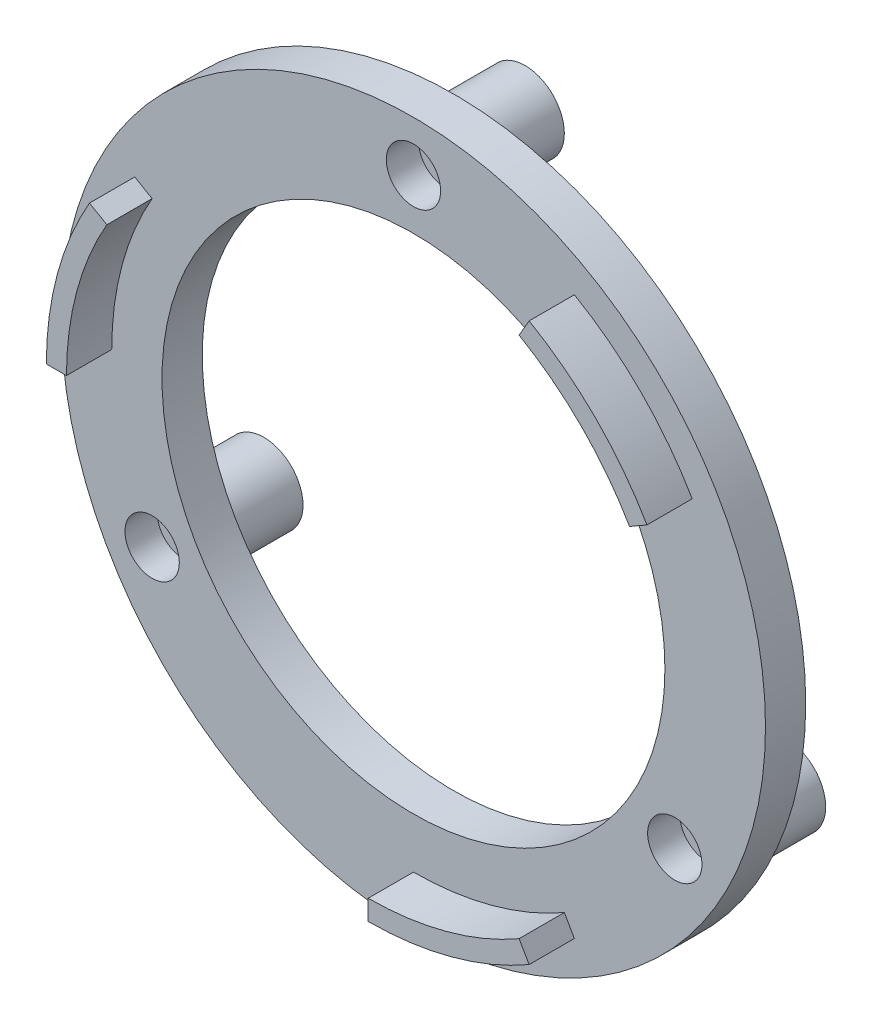
ISO-10303-21;
HEADER;
FILE_DESCRIPTION(('STEP AP214'),'2;1');
FILE_NAME('part.step','',(''),(''),'','','');
FILE_SCHEMA(('AUTOMOTIVE_DESIGN { 1 0 10303 214 1 1 1 1 }'));
ENDSEC;
DATA;
#1=APPLICATION_CONTEXT('core data for automotive mechanical design processes');
#2=APPLICATION_PROTOCOL_DEFINITION('international standard','automotive_design',2000,#1);
#3=PRODUCT_CONTEXT('',#1,'mechanical');
#4=PRODUCT('Part','Part','',(#3));
#5=PRODUCT_RELATED_PRODUCT_CATEGORY('part','',(#4));
#6=PRODUCT_DEFINITION_FORMATION('','',#4);
#7=PRODUCT_DEFINITION_CONTEXT('part definition',#1,'design');
#8=PRODUCT_DEFINITION('design','',#6,#7);
#9=PRODUCT_DEFINITION_SHAPE('','',#8);
#10=(LENGTH_UNIT() NAMED_UNIT(*) SI_UNIT(.MILLI.,.METRE.));
#11=(NAMED_UNIT(*) PLANE_ANGLE_UNIT() SI_UNIT($,.RADIAN.));
#12=(NAMED_UNIT(*) SI_UNIT($,.STERADIAN.) SOLID_ANGLE_UNIT());
#13=UNCERTAINTY_MEASURE_WITH_UNIT(LENGTH_MEASURE(1.E-05),#10,'distance_accuracy_value','');
#14=(GEOMETRIC_REPRESENTATION_CONTEXT(3) GLOBAL_UNCERTAINTY_ASSIGNED_CONTEXT((#13)) GLOBAL_UNIT_ASSIGNED_CONTEXT((#10,
#11,#12)) REPRESENTATION_CONTEXT('',''));
#15=CARTESIAN_POINT('',(0.,0.,0.));
#16=DIRECTION('',(0.,0.,1.));
#17=DIRECTION('',(1.,0.,0.));
#18=AXIS2_PLACEMENT_3D('',#15,#16,#17);
#19=CARTESIAN_POINT('',(0.,0.,4.));
#20=DIRECTION('',(0.,0.,1.));
#21=DIRECTION('',(1.,0.,0.));
#22=AXIS2_PLACEMENT_3D('',#19,#20,#21);
#23=PLANE('',#22);
#24=CARTESIAN_POINT('',(0.,0.,4.));
#25=DIRECTION('',(0.,0.,1.));
#26=DIRECTION('',(1.,0.,0.));
#27=AXIS2_PLACEMENT_3D('',#24,#25,#26);
#28=CIRCLE('',#27,30.);
#29=CARTESIAN_POINT('',(25.9807621135331,15.,4.));
#30=VERTEX_POINT('',#29);
#31=CARTESIAN_POINT('',(14.9999999999999,25.9807621135332,4.));
#32=VERTEX_POINT('',#31);
#33=EDGE_CURVE('E183',#30,#32,#28,.T.);
#34=ORIENTED_EDGE('',*,*,#33,.T.);
#35=DIRECTION('',(0.499999999999998,0.86602540378444,0.));
#36=VECTOR('',#35,1.);
#37=CARTESIAN_POINT('',(0.,0.,4.));
#38=LINE('',#37,#36);
#39=CARTESIAN_POINT('',(15.9999999999999,27.7128129211021,4.));
#40=VERTEX_POINT('',#39);
#41=EDGE_CURVE('E196',#32,#40,#38,.T.);
#42=ORIENTED_EDGE('',*,*,#41,.T.);
#43=CARTESIAN_POINT('',(0.,0.,4.));
#44=DIRECTION('',(0.,0.,1.));
#45=DIRECTION('',(1.,0.,0.));
#46=AXIS2_PLACEMENT_3D('',#43,#44,#45);
#47=CIRCLE('',#46,32.);
#48=CARTESIAN_POINT('',(27.712812921102,16.,4.));
#49=VERTEX_POINT('',#48);
#50=EDGE_CURVE('E208',#49,#40,#47,.T.);
#51=ORIENTED_EDGE('',*,*,#50,.F.);
#52=DIRECTION('',(0.866025403784438,0.500000000000001,0.));
#53=VECTOR('',#52,1.);
#54=CARTESIAN_POINT('',(0.,0.,4.));
#55=LINE('',#54,#53);
#56=EDGE_CURVE('E205',#30,#49,#55,.T.);
#57=ORIENTED_EDGE('',*,*,#56,.F.);
#58=EDGE_LOOP('',(#34,#42,#51,#57));
#59=FACE_BOUND('',#58,.T.);
#60=CARTESIAN_POINT('',(0.,30.,4.));
#61=DIRECTION('',(0.,0.,1.));
#62=DIRECTION('',(1.,0.,0.));
#63=AXIS2_PLACEMENT_3D('',#60,#61,#62);
#64=CIRCLE('',#63,2.7);
#65=CARTESIAN_POINT('',(2.7,30.,4.));
#66=VERTEX_POINT('',#65);
#67=EDGE_CURVE('E228',#66,#66,#64,.T.);
#68=ORIENTED_EDGE('',*,*,#67,.F.);
#69=EDGE_LOOP('',(#68));
#70=FACE_BOUND('',#69,.T.);
#71=CARTESIAN_POINT('',(25.9807621135351,-14.9999999999989,4.));
#72=DIRECTION('',(0.,0.,1.));
#73=DIRECTION('',(1.,0.,0.));
#74=AXIS2_PLACEMENT_3D('',#71,#72,#73);
#75=CIRCLE('',#74,2.70000000000167);
#76=CARTESIAN_POINT('',(28.6807621135367,-14.9999999999989,4.));
#77=VERTEX_POINT('',#76);
#78=EDGE_CURVE('E231',#77,#77,#75,.T.);
#79=ORIENTED_EDGE('',*,*,#78,.F.);
#80=EDGE_LOOP('',(#79));
#81=FACE_BOUND('',#80,.T.);
#82=CARTESIAN_POINT('',(-25.9807621135312,-15.0000000000011,4.));
#83=DIRECTION('',(0.,0.,1.));
#84=DIRECTION('',(1.,0.,0.));
#85=AXIS2_PLACEMENT_3D('',#82,#83,#84);
#86=CIRCLE('',#85,2.70000000000243);
#87=CARTESIAN_POINT('',(-23.2807621135288,-15.0000000000011,4.));
#88=VERTEX_POINT('',#87);
#89=EDGE_CURVE('E237',#88,#88,#86,.T.);
#90=ORIENTED_EDGE('',*,*,#89,.F.);
#91=EDGE_LOOP('',(#90));
#92=FACE_BOUND('',#91,.T.);
#93=CARTESIAN_POINT('',(0.,0.,4.));
#94=DIRECTION('',(0.,0.,1.));
#95=DIRECTION('',(1.,0.,0.));
#96=AXIS2_PLACEMENT_3D('',#93,#94,#95);
#97=CIRCLE('',#96,35.);
#98=CARTESIAN_POINT('',(35.,0.,4.));
#99=VERTEX_POINT('',#98);
#100=EDGE_CURVE('E261',#99,#99,#97,.T.);
#101=ORIENTED_EDGE('',*,*,#100,.T.);
#102=EDGE_LOOP('',(#101));
#103=FACE_BOUND('',#102,.T.);
#104=CARTESIAN_POINT('',(0.,0.,4.));
#105=DIRECTION('',(0.,0.,1.));
#106=DIRECTION('',(1.,0.,0.));
#107=AXIS2_PLACEMENT_3D('',#104,#105,#106);
#108=CIRCLE('',#107,25.);
#109=CARTESIAN_POINT('',(25.,0.,4.));
#110=VERTEX_POINT('',#109);
#111=EDGE_CURVE('E264',#110,#110,#108,.T.);
#112=ORIENTED_EDGE('',*,*,#111,.F.);
#113=EDGE_LOOP('',(#112));
#114=FACE_BOUND('',#113,.T.);
#115=DIRECTION('',(1.,0.,0.));
#116=VECTOR('',#115,1.);
#117=CARTESIAN_POINT('',(-32.,2.15105711021124E-13,4.));
#118=LINE('',#117,#116);
#119=CARTESIAN_POINT('',(-32.,2.15105711021124E-13,4.));
#120=VERTEX_POINT('',#119);
#121=CARTESIAN_POINT('',(-30.,2.02962646689286E-13,4.));
#122=VERTEX_POINT('',#121);
#123=EDGE_CURVE('E177',#120,#122,#118,.T.);
#124=ORIENTED_EDGE('',*,*,#123,.F.);
#125=CARTESIAN_POINT('',(0.,0.,4.));
#126=DIRECTION('',(0.,0.,1.));
#127=DIRECTION('',(1.,0.,0.));
#128=AXIS2_PLACEMENT_3D('',#125,#126,#127);
#129=CIRCLE('',#128,32.);
#130=CARTESIAN_POINT('',(-27.7128129211019,16.0000000000002,4.));
#131=VERTEX_POINT('',#130);
#132=EDGE_CURVE('E180',#131,#120,#129,.T.);
#133=ORIENTED_EDGE('',*,*,#132,.F.);
#134=DIRECTION('',(-0.866025403784435,0.500000000000007,0.));
#135=VECTOR('',#134,1.);
#136=CARTESIAN_POINT('',(-25.980762113533,15.0000000000002,4.));
#137=LINE('',#136,#135);
#138=CARTESIAN_POINT('',(-25.980762113533,15.0000000000002,4.));
#139=VERTEX_POINT('',#138);
#140=EDGE_CURVE('E173',#139,#131,#137,.T.);
#141=ORIENTED_EDGE('',*,*,#140,.F.);
#142=CARTESIAN_POINT('',(0.,0.,4.));
#143=DIRECTION('',(0.,0.,1.));
#144=DIRECTION('',(1.,0.,0.));
#145=AXIS2_PLACEMENT_3D('',#142,#143,#144);
#146=CIRCLE('',#145,30.);
#147=EDGE_CURVE('E64',#139,#122,#146,.T.);
#148=ORIENTED_EDGE('',*,*,#147,.T.);
#149=EDGE_LOOP('',(#124,#133,#141,#148));
#150=FACE_BOUND('',#149,.T.);
#151=DIRECTION('',(-0.499999999999998,0.86602540378444,0.));
#152=VECTOR('',#151,1.);
#153=CARTESIAN_POINT('',(15.9999999999999,-27.7128129211021,4.));
#154=LINE('',#153,#152);
#155=CARTESIAN_POINT('',(15.9999999999999,-27.7128129211021,4.));
#156=VERTEX_POINT('',#155);
#157=CARTESIAN_POINT('',(14.9999999999999,-25.9807621135332,4.));
#158=VERTEX_POINT('',#157);
#159=EDGE_CURVE('E151',#156,#158,#154,.T.);
#160=ORIENTED_EDGE('',*,*,#159,.F.);
#161=CARTESIAN_POINT('',(0.,0.,4.));
#162=DIRECTION('',(0.,0.,1.));
#163=DIRECTION('',(1.,0.,0.));
#164=AXIS2_PLACEMENT_3D('',#161,#162,#163);
#165=CIRCLE('',#164,32.);
#166=CARTESIAN_POINT('',(-1.12757025938492E-13,-32.,4.));
#167=VERTEX_POINT('',#166);
#168=EDGE_CURVE('E145',#167,#156,#165,.T.);
#169=ORIENTED_EDGE('',*,*,#168,.F.);
#170=DIRECTION('',(0.,-1.,0.));
#171=VECTOR('',#170,1.);
#172=CARTESIAN_POINT('',(-1.05818132034585E-13,-30.,4.));
#173=LINE('',#172,#171);
#174=CARTESIAN_POINT('',(-1.05818132034585E-13,-30.,4.));
#175=VERTEX_POINT('',#174);
#176=EDGE_CURVE('E130',#175,#167,#173,.T.);
#177=ORIENTED_EDGE('',*,*,#176,.F.);
#178=CARTESIAN_POINT('',(0.,0.,4.));
#179=DIRECTION('',(0.,0.,1.));
#180=DIRECTION('',(1.,0.,0.));
#181=AXIS2_PLACEMENT_3D('',#178,#179,#180);
#182=CIRCLE('',#181,30.);
#183=EDGE_CURVE('E56',#175,#158,#182,.T.);
#184=ORIENTED_EDGE('',*,*,#183,.T.);
#185=EDGE_LOOP('',(#160,#169,#177,#184));
#186=FACE_BOUND('',#185,.T.);
#187=ADVANCED_FACE('F39',(#59,#70,#81,#92,#103,#114,#150,#186),#23,.T.);
#188=CARTESIAN_POINT('',(-25.9807621135351,-14.9999999999989,7.9));
#189=DIRECTION('',(0.,0.,-1.));
#190=DIRECTION('',(-1.,0.,0.));
#191=AXIS2_PLACEMENT_3D('',#188,#189,#190);
#192=CYLINDRICAL_SURFACE('',#191,1.60000000000166);
#193=CARTESIAN_POINT('',(-25.9807621135351,-14.9999999999989,-7.1));
#194=DIRECTION('',(0.,0.,-1.));
#195=DIRECTION('',(-1.,0.,0.));
#196=AXIS2_PLACEMENT_3D('',#193,#194,#195);
#197=CIRCLE('',#196,1.60000000000166);
#198=CARTESIAN_POINT('',(-27.5807621135367,-14.9999999999989,-7.1));
#199=VERTEX_POINT('',#198);
#200=EDGE_CURVE('E246',#199,#199,#197,.T.);
#201=ORIENTED_EDGE('',*,*,#200,.T.);
#202=EDGE_LOOP('',(#201));
#203=FACE_BOUND('',#202,.T.);
#204=CARTESIAN_POINT('',(-25.9807621135351,-14.9999999999989,0.8));
#205=DIRECTION('',(0.,0.,1.));
#206=DIRECTION('',(1.,0.,0.));
#207=AXIS2_PLACEMENT_3D('',#204,#205,#206);
#208=CIRCLE('',#207,1.60000000000166);
#209=CARTESIAN_POINT('',(-24.3807621135334,-14.9999999999989,0.8));
#210=VERTEX_POINT('',#209);
#211=EDGE_CURVE('E43',#210,#210,#208,.F.);
#212=ORIENTED_EDGE('',*,*,#211,.F.);
#213=EDGE_LOOP('',(#212));
#214=FACE_BOUND('',#213,.T.);
#215=ADVANCED_FACE('F287',(#203,#214),#192,.F.);
#216=CARTESIAN_POINT('',(25.9807621135312,-15.0000000000011,7.9));
#217=DIRECTION('',(0.,0.,-1.));
#218=DIRECTION('',(-1.,0.,0.));
#219=AXIS2_PLACEMENT_3D('',#216,#217,#218);
#220=CYLINDRICAL_SURFACE('',#219,1.60000000000243);
#221=CARTESIAN_POINT('',(25.9807621135312,-15.0000000000011,-7.1));
#222=DIRECTION('',(0.,0.,-1.));
#223=DIRECTION('',(-1.,0.,0.));
#224=AXIS2_PLACEMENT_3D('',#221,#222,#223);
#225=CIRCLE('',#224,1.60000000000243);
#226=CARTESIAN_POINT('',(24.3807621135288,-15.0000000000011,-7.1));
#227=VERTEX_POINT('',#226);
#228=EDGE_CURVE('E249',#227,#227,#225,.T.);
#229=ORIENTED_EDGE('',*,*,#228,.T.);
#230=EDGE_LOOP('',(#229));
#231=FACE_BOUND('',#230,.T.);
#232=CARTESIAN_POINT('',(25.9807621135312,-15.0000000000011,0.8));
#233=DIRECTION('',(0.,0.,1.));
#234=DIRECTION('',(1.,0.,0.));
#235=AXIS2_PLACEMENT_3D('',#232,#233,#234);
#236=CIRCLE('',#235,1.60000000000243);
#237=CARTESIAN_POINT('',(27.5807621135337,-15.0000000000011,0.8));
#238=VERTEX_POINT('',#237);
#239=EDGE_CURVE('E278',#238,#238,#236,.F.);
#240=ORIENTED_EDGE('',*,*,#239,.F.);
#241=EDGE_LOOP('',(#240));
#242=FACE_BOUND('',#241,.T.);
#243=ADVANCED_FACE('F289',(#231,#242),#220,.F.);
#244=CARTESIAN_POINT('',(0.,30.,7.9));
#245=DIRECTION('',(0.,0.,-1.));
#246=DIRECTION('',(-1.,0.,0.));
#247=AXIS2_PLACEMENT_3D('',#244,#245,#246);
#248=CYLINDRICAL_SURFACE('',#247,1.6);
#249=CARTESIAN_POINT('',(0.,30.,-7.1));
#250=DIRECTION('',(0.,0.,-1.));
#251=DIRECTION('',(-1.,0.,0.));
#252=AXIS2_PLACEMENT_3D('',#249,#250,#251);
#253=CIRCLE('',#252,1.6);
#254=CARTESIAN_POINT('',(-1.6,30.,-7.1));
#255=VERTEX_POINT('',#254);
#256=EDGE_CURVE('E242',#255,#255,#253,.T.);
#257=ORIENTED_EDGE('',*,*,#256,.T.);
#258=EDGE_LOOP('',(#257));
#259=FACE_BOUND('',#258,.T.);
#260=CARTESIAN_POINT('',(0.,30.,0.8));
#261=DIRECTION('',(0.,0.,1.));
#262=DIRECTION('',(1.,0.,0.));
#263=AXIS2_PLACEMENT_3D('',#260,#261,#262);
#264=CIRCLE('',#263,1.6);
#265=CARTESIAN_POINT('',(1.6,30.,0.8));
#266=VERTEX_POINT('',#265);
#267=EDGE_CURVE('E227',#266,#266,#264,.F.);
#268=ORIENTED_EDGE('',*,*,#267,.F.);
#269=EDGE_LOOP('',(#268));
#270=FACE_BOUND('',#269,.T.);
#271=ADVANCED_FACE('F296',(#259,#270),#248,.F.);
#272=CARTESIAN_POINT('',(0.,0.,4.));
#273=DIRECTION('',(0.,0.,-1.));
#274=DIRECTION('',(-1.,0.,0.));
#275=AXIS2_PLACEMENT_3D('',#272,#273,#274);
#276=CYLINDRICAL_SURFACE('',#275,35.);
#277=ORIENTED_EDGE('',*,*,#100,.F.);
#278=EDGE_LOOP('',(#277));
#279=FACE_BOUND('',#278,.T.);
#280=CARTESIAN_POINT('',(0.,0.,0.));
#281=DIRECTION('',(0.,0.,1.));
#282=DIRECTION('',(1.,0.,0.));
#283=AXIS2_PLACEMENT_3D('',#280,#281,#282);
#284=CIRCLE('',#283,35.);
#285=CARTESIAN_POINT('',(35.,0.,0.));
#286=VERTEX_POINT('',#285);
#287=EDGE_CURVE('E260',#286,#286,#284,.T.);
#288=ORIENTED_EDGE('',*,*,#287,.T.);
#289=EDGE_LOOP('',(#288));
#290=FACE_BOUND('',#289,.T.);
#291=ADVANCED_FACE('F41',(#279,#290),#276,.T.);
#292=CARTESIAN_POINT('',(0.,0.,4.));
#293=DIRECTION('',(0.,0.,-1.));
#294=DIRECTION('',(-1.,0.,0.));
#295=AXIS2_PLACEMENT_3D('',#292,#293,#294);
#296=CYLINDRICAL_SURFACE('',#295,25.);
#297=ORIENTED_EDGE('',*,*,#111,.T.);
#298=EDGE_LOOP('',(#297));
#299=FACE_BOUND('',#298,.T.);
#300=CARTESIAN_POINT('',(0.,0.,0.));
#301=DIRECTION('',(0.,0.,1.));
#302=DIRECTION('',(1.,0.,0.));
#303=AXIS2_PLACEMENT_3D('',#300,#301,#302);
#304=CIRCLE('',#303,25.);
#305=CARTESIAN_POINT('',(25.,0.,0.));
#306=VERTEX_POINT('',#305);
#307=EDGE_CURVE('E265',#306,#306,#304,.T.);
#308=ORIENTED_EDGE('',*,*,#307,.F.);
#309=EDGE_LOOP('',(#308));
#310=FACE_BOUND('',#309,.T.);
#311=ADVANCED_FACE('F331',(#299,#310),#296,.F.);
#312=CARTESIAN_POINT('',(0.,0.,0.));
#313=DIRECTION('',(0.,0.,1.));
#314=DIRECTION('',(1.,0.,0.));
#315=AXIS2_PLACEMENT_3D('',#312,#313,#314);
#316=PLANE('',#315);
#317=CARTESIAN_POINT('',(-25.9807621135351,-14.9999999999989,0.));
#318=DIRECTION('',(0.,0.,1.));
#319=DIRECTION('',(1.,0.,0.));
#320=AXIS2_PLACEMENT_3D('',#317,#318,#319);
#321=CIRCLE('',#320,3.90000000000166);
#322=CARTESIAN_POINT('',(-22.0807621135334,-14.9999999999989,0.));
#323=VERTEX_POINT('',#322);
#324=EDGE_CURVE('E11',#323,#323,#321,.F.);
#325=ORIENTED_EDGE('',*,*,#324,.F.);
#326=EDGE_LOOP('',(#325));
#327=FACE_BOUND('',#326,.T.);
#328=CARTESIAN_POINT('',(25.9807621135312,-15.0000000000011,0.));
#329=DIRECTION('',(0.,0.,1.));
#330=DIRECTION('',(1.,0.,0.));
#331=AXIS2_PLACEMENT_3D('',#328,#329,#330);
#332=CIRCLE('',#331,3.90000000000243);
#333=CARTESIAN_POINT('',(29.8807621135337,-15.0000000000011,0.));
#334=VERTEX_POINT('',#333);
#335=EDGE_CURVE('E48',#334,#334,#332,.F.);
#336=ORIENTED_EDGE('',*,*,#335,.F.);
#337=EDGE_LOOP('',(#336));
#338=FACE_BOUND('',#337,.T.);
#339=CARTESIAN_POINT('',(0.,30.,0.));
#340=DIRECTION('',(0.,0.,1.));
#341=DIRECTION('',(1.,0.,0.));
#342=AXIS2_PLACEMENT_3D('',#339,#340,#341);
#343=CIRCLE('',#342,3.9);
#344=CARTESIAN_POINT('',(3.9,30.,0.));
#345=VERTEX_POINT('',#344);
#346=EDGE_CURVE('E268',#345,#345,#343,.F.);
#347=ORIENTED_EDGE('',*,*,#346,.F.);
#348=EDGE_LOOP('',(#347));
#349=FACE_BOUND('',#348,.T.);
#350=ORIENTED_EDGE('',*,*,#287,.F.);
#351=EDGE_LOOP('',(#350));
#352=FACE_BOUND('',#351,.T.);
#353=ORIENTED_EDGE('',*,*,#307,.T.);
#354=EDGE_LOOP('',(#353));
#355=FACE_BOUND('',#354,.T.);
#356=ADVANCED_FACE('F327',(#327,#338,#349,#352,#355),#316,.F.);
#357=CARTESIAN_POINT('',(0.,30.,-7.1));
#358=DIRECTION('',(0.,0.,1.));
#359=DIRECTION('',(1.,0.,0.));
#360=AXIS2_PLACEMENT_3D('',#357,#358,#359);
#361=CYLINDRICAL_SURFACE('',#360,3.9);
#362=CARTESIAN_POINT('',(0.,30.,-7.1));
#363=DIRECTION('',(0.,0.,-1.));
#364=DIRECTION('',(-1.,0.,0.));
#365=AXIS2_PLACEMENT_3D('',#362,#363,#364);
#366=CIRCLE('',#365,3.9);
#367=CARTESIAN_POINT('',(-3.9,30.,-7.1));
#368=VERTEX_POINT('',#367);
#369=EDGE_CURVE('E257',#368,#368,#366,.T.);
#370=ORIENTED_EDGE('',*,*,#369,.F.);
#371=EDGE_LOOP('',(#370));
#372=FACE_BOUND('',#371,.T.);
#373=ORIENTED_EDGE('',*,*,#346,.T.);
#374=EDGE_LOOP('',(#373));
#375=FACE_BOUND('',#374,.T.);
#376=ADVANCED_FACE('F324',(#372,#375),#361,.T.);
#377=CARTESIAN_POINT('',(0.,30.,-7.1));
#378=DIRECTION('',(0.,0.,-1.));
#379=DIRECTION('',(-1.,0.,0.));
#380=AXIS2_PLACEMENT_3D('',#377,#378,#379);
#381=PLANE('',#380);
#382=ORIENTED_EDGE('',*,*,#256,.F.);
#383=EDGE_LOOP('',(#382));
#384=FACE_BOUND('',#383,.T.);
#385=ORIENTED_EDGE('',*,*,#369,.T.);
#386=EDGE_LOOP('',(#385));
#387=FACE_BOUND('',#386,.T.);
#388=ADVANCED_FACE('F317',(#384,#387),#381,.T.);
#389=CARTESIAN_POINT('',(25.9807621135312,-15.0000000000011,-7.1));
#390=DIRECTION('',(0.,0.,1.));
#391=DIRECTION('',(1.,0.,0.));
#392=AXIS2_PLACEMENT_3D('',#389,#390,#391);
#393=CYLINDRICAL_SURFACE('',#392,3.90000000000243);
#394=CARTESIAN_POINT('',(25.9807621135312,-15.0000000000011,-7.1));
#395=DIRECTION('',(0.,0.,-1.));
#396=DIRECTION('',(-1.,0.,0.));
#397=AXIS2_PLACEMENT_3D('',#394,#395,#396);
#398=CIRCLE('',#397,3.90000000000243);
#399=CARTESIAN_POINT('',(22.0807621135288,-15.0000000000011,-7.1));
#400=VERTEX_POINT('',#399);
#401=EDGE_CURVE('E254',#400,#400,#398,.T.);
#402=ORIENTED_EDGE('',*,*,#401,.F.);
#403=EDGE_LOOP('',(#402));
#404=FACE_BOUND('',#403,.T.);
#405=ORIENTED_EDGE('',*,*,#335,.T.);
#406=EDGE_LOOP('',(#405));
#407=FACE_BOUND('',#406,.T.);
#408=ADVANCED_FACE('F314',(#404,#407),#393,.T.);
#409=CARTESIAN_POINT('',(25.9807621135312,-15.0000000000011,-7.1));
#410=DIRECTION('',(0.,0.,-1.));
#411=DIRECTION('',(-1.,0.,0.));
#412=AXIS2_PLACEMENT_3D('',#409,#410,#411);
#413=PLANE('',#412);
#414=ORIENTED_EDGE('',*,*,#228,.F.);
#415=EDGE_LOOP('',(#414));
#416=FACE_BOUND('',#415,.T.);
#417=ORIENTED_EDGE('',*,*,#401,.T.);
#418=EDGE_LOOP('',(#417));
#419=FACE_BOUND('',#418,.T.);
#420=ADVANCED_FACE('F308',(#416,#419),#413,.T.);
#421=CARTESIAN_POINT('',(-25.9807621135351,-14.9999999999989,-7.1));
#422=DIRECTION('',(0.,0.,1.));
#423=DIRECTION('',(1.,0.,0.));
#424=AXIS2_PLACEMENT_3D('',#421,#422,#423);
#425=CYLINDRICAL_SURFACE('',#424,3.90000000000166);
#426=CARTESIAN_POINT('',(-25.9807621135351,-14.9999999999989,-7.1));
#427=DIRECTION('',(0.,0.,-1.));
#428=DIRECTION('',(-1.,0.,0.));
#429=AXIS2_PLACEMENT_3D('',#426,#427,#428);
#430=CIRCLE('',#429,3.90000000000166);
#431=CARTESIAN_POINT('',(-29.8807621135367,-14.9999999999989,-7.1));
#432=VERTEX_POINT('',#431);
#433=EDGE_CURVE('E245',#432,#432,#430,.T.);
#434=ORIENTED_EDGE('',*,*,#433,.F.);
#435=EDGE_LOOP('',(#434));
#436=FACE_BOUND('',#435,.T.);
#437=ORIENTED_EDGE('',*,*,#324,.T.);
#438=EDGE_LOOP('',(#437));
#439=FACE_BOUND('',#438,.T.);
#440=ADVANCED_FACE('F304',(#436,#439),#425,.T.);
#441=CARTESIAN_POINT('',(-25.9807621135351,-14.9999999999989,-7.1));
#442=DIRECTION('',(0.,0.,-1.));
#443=DIRECTION('',(-1.,0.,0.));
#444=AXIS2_PLACEMENT_3D('',#441,#442,#443);
#445=PLANE('',#444);
#446=ORIENTED_EDGE('',*,*,#200,.F.);
#447=EDGE_LOOP('',(#446));
#448=FACE_BOUND('',#447,.T.);
#449=ORIENTED_EDGE('',*,*,#433,.T.);
#450=EDGE_LOOP('',(#449));
#451=FACE_BOUND('',#450,.T.);
#452=ADVANCED_FACE('F307',(#448,#451),#445,.T.);
#453=CARTESIAN_POINT('',(0.,30.,0.8));
#454=DIRECTION('',(0.,0.,1.));
#455=DIRECTION('',(1.,0.,0.));
#456=AXIS2_PLACEMENT_3D('',#453,#454,#455);
#457=PLANE('',#456);
#458=CARTESIAN_POINT('',(0.,30.,0.8));
#459=DIRECTION('',(0.,0.,1.));
#460=DIRECTION('',(1.,0.,0.));
#461=AXIS2_PLACEMENT_3D('',#458,#459,#460);
#462=CIRCLE('',#461,2.7);
#463=CARTESIAN_POINT('',(2.7,30.,0.8));
#464=VERTEX_POINT('',#463);
#465=EDGE_CURVE('E224',#464,#464,#462,.T.);
#466=ORIENTED_EDGE('',*,*,#465,.T.);
#467=EDGE_LOOP('',(#466));
#468=FACE_BOUND('',#467,.T.);
#469=ORIENTED_EDGE('',*,*,#267,.T.);
#470=EDGE_LOOP('',(#469));
#471=FACE_BOUND('',#470,.T.);
#472=ADVANCED_FACE('F312',(#468,#471),#457,.T.);
#473=CARTESIAN_POINT('',(0.,30.,0.8));
#474=DIRECTION('',(0.,0.,1.));
#475=DIRECTION('',(1.,0.,0.));
#476=AXIS2_PLACEMENT_3D('',#473,#474,#475);
#477=CYLINDRICAL_SURFACE('',#476,2.7);
#478=ORIENTED_EDGE('',*,*,#465,.F.);
#479=EDGE_LOOP('',(#478));
#480=FACE_BOUND('',#479,.T.);
#481=ORIENTED_EDGE('',*,*,#67,.T.);
#482=EDGE_LOOP('',(#481));
#483=FACE_BOUND('',#482,.T.);
#484=ADVANCED_FACE('F397',(#480,#483),#477,.F.);
#485=CARTESIAN_POINT('',(25.9807621135351,-14.9999999999989,0.8));
#486=DIRECTION('',(0.,0.,1.));
#487=DIRECTION('',(1.,0.,0.));
#488=AXIS2_PLACEMENT_3D('',#485,#486,#487);
#489=PLANE('',#488);
#490=CARTESIAN_POINT('',(25.9807621135351,-14.9999999999989,0.8));
#491=DIRECTION('',(0.,0.,1.));
#492=DIRECTION('',(1.,0.,0.));
#493=AXIS2_PLACEMENT_3D('',#490,#491,#492);
#494=CIRCLE('',#493,2.70000000000167);
#495=CARTESIAN_POINT('',(28.6807621135367,-14.9999999999989,0.8));
#496=VERTEX_POINT('',#495);
#497=EDGE_CURVE('E234',#496,#496,#494,.T.);
#498=ORIENTED_EDGE('',*,*,#497,.T.);
#499=EDGE_LOOP('',(#498));
#500=FACE_BOUND('',#499,.T.);
#501=ORIENTED_EDGE('',*,*,#239,.T.);
#502=EDGE_LOOP('',(#501));
#503=FACE_BOUND('',#502,.T.);
#504=ADVANCED_FACE('F401',(#500,#503),#489,.T.);
#505=CARTESIAN_POINT('',(25.9807621135351,-14.9999999999989,0.8));
#506=DIRECTION('',(0.,0.,1.));
#507=DIRECTION('',(1.,0.,0.));
#508=AXIS2_PLACEMENT_3D('',#505,#506,#507);
#509=CYLINDRICAL_SURFACE('',#508,2.70000000000167);
#510=ORIENTED_EDGE('',*,*,#497,.F.);
#511=EDGE_LOOP('',(#510));
#512=FACE_BOUND('',#511,.T.);
#513=ORIENTED_EDGE('',*,*,#78,.T.);
#514=EDGE_LOOP('',(#513));
#515=FACE_BOUND('',#514,.T.);
#516=ADVANCED_FACE('F403',(#512,#515),#509,.F.);
#517=CARTESIAN_POINT('',(-25.9807621135312,-15.0000000000011,0.8));
#518=DIRECTION('',(0.,0.,1.));
#519=DIRECTION('',(1.,0.,0.));
#520=AXIS2_PLACEMENT_3D('',#517,#518,#519);
#521=PLANE('',#520);
#522=CARTESIAN_POINT('',(-25.9807621135312,-15.0000000000011,0.8));
#523=DIRECTION('',(0.,0.,1.));
#524=DIRECTION('',(1.,0.,0.));
#525=AXIS2_PLACEMENT_3D('',#522,#523,#524);
#526=CIRCLE('',#525,2.70000000000243);
#527=CARTESIAN_POINT('',(-23.2807621135288,-15.0000000000011,0.8));
#528=VERTEX_POINT('',#527);
#529=EDGE_CURVE('E223',#528,#528,#526,.T.);
#530=ORIENTED_EDGE('',*,*,#529,.T.);
#531=EDGE_LOOP('',(#530));
#532=FACE_BOUND('',#531,.T.);
#533=ORIENTED_EDGE('',*,*,#211,.T.);
#534=EDGE_LOOP('',(#533));
#535=FACE_BOUND('',#534,.T.);
#536=ADVANCED_FACE('F285',(#532,#535),#521,.T.);
#537=CARTESIAN_POINT('',(-25.9807621135312,-15.0000000000011,0.8));
#538=DIRECTION('',(0.,0.,1.));
#539=DIRECTION('',(1.,0.,0.));
#540=AXIS2_PLACEMENT_3D('',#537,#538,#539);
#541=CYLINDRICAL_SURFACE('',#540,2.70000000000243);
#542=ORIENTED_EDGE('',*,*,#529,.F.);
#543=EDGE_LOOP('',(#542));
#544=FACE_BOUND('',#543,.T.);
#545=ORIENTED_EDGE('',*,*,#89,.T.);
#546=EDGE_LOOP('',(#545));
#547=FACE_BOUND('',#546,.T.);
#548=ADVANCED_FACE('F393',(#544,#547),#541,.F.);
#549=CARTESIAN_POINT('',(0.,0.,8.5));
#550=DIRECTION('',(0.,0.,-1.));
#551=DIRECTION('',(-1.,0.,0.));
#552=AXIS2_PLACEMENT_3D('',#549,#550,#551);
#553=CYLINDRICAL_SURFACE('',#552,30.);
#554=ORIENTED_EDGE('',*,*,#33,.F.);
#555=DIRECTION('',(0.,0.,-1.));
#556=VECTOR('',#555,1.);
#557=CARTESIAN_POINT('',(25.9807621135331,15.,8.5));
#558=LINE('',#557,#556);
#559=CARTESIAN_POINT('',(25.9807621135331,15.,8.5));
#560=VERTEX_POINT('',#559);
#561=EDGE_CURVE('E220',#560,#30,#558,.T.);
#562=ORIENTED_EDGE('',*,*,#561,.F.);
#563=CARTESIAN_POINT('',(0.,0.,8.5));
#564=DIRECTION('',(0.,0.,1.));
#565=DIRECTION('',(1.,0.,0.));
#566=AXIS2_PLACEMENT_3D('',#563,#564,#565);
#567=CIRCLE('',#566,30.);
#568=CARTESIAN_POINT('',(14.9999999999999,25.9807621135332,8.5));
#569=VERTEX_POINT('',#568);
#570=EDGE_CURVE('E192',#560,#569,#567,.T.);
#571=ORIENTED_EDGE('',*,*,#570,.T.);
#572=DIRECTION('',(0.,0.,-1.));
#573=VECTOR('',#572,1.);
#574=CARTESIAN_POINT('',(14.9999999999999,25.9807621135332,8.5));
#575=LINE('',#574,#573);
#576=EDGE_CURVE('E203',#569,#32,#575,.T.);
#577=ORIENTED_EDGE('',*,*,#576,.T.);
#578=EDGE_LOOP('',(#554,#562,#571,#577));
#579=FACE_BOUND('',#578,.T.);
#580=ADVANCED_FACE('F389',(#579),#553,.F.);
#581=CARTESIAN_POINT('',(0.,0.,8.5));
#582=DIRECTION('',(-0.500000000000001,0.866025403784438,0.));
#583=DIRECTION('',(-0.866025403784438,-0.500000000000001,0.));
#584=AXIS2_PLACEMENT_3D('',#581,#582,#583);
#585=PLANE('',#584);
#586=ORIENTED_EDGE('',*,*,#56,.T.);
#587=DIRECTION('',(0.,0.,-1.));
#588=VECTOR('',#587,1.);
#589=CARTESIAN_POINT('',(27.712812921102,16.,8.5));
#590=LINE('',#589,#588);
#591=CARTESIAN_POINT('',(27.712812921102,16.,8.5));
#592=VERTEX_POINT('',#591);
#593=EDGE_CURVE('E217',#592,#49,#590,.T.);
#594=ORIENTED_EDGE('',*,*,#593,.F.);
#595=DIRECTION('',(0.866025403784438,0.500000000000001,0.));
#596=VECTOR('',#595,1.);
#597=CARTESIAN_POINT('',(0.,0.,8.5));
#598=LINE('',#597,#596);
#599=EDGE_CURVE('E195',#560,#592,#598,.T.);
#600=ORIENTED_EDGE('',*,*,#599,.F.);
#601=ORIENTED_EDGE('',*,*,#561,.T.);
#602=EDGE_LOOP('',(#586,#594,#600,#601));
#603=FACE_BOUND('',#602,.T.);
#604=ADVANCED_FACE('F385',(#603),#585,.F.);
#605=CARTESIAN_POINT('',(0.,0.,8.5));
#606=DIRECTION('',(0.,0.,-1.));
#607=DIRECTION('',(-1.,0.,0.));
#608=AXIS2_PLACEMENT_3D('',#605,#606,#607);
#609=CYLINDRICAL_SURFACE('',#608,32.);
#610=ORIENTED_EDGE('',*,*,#50,.T.);
#611=DIRECTION('',(0.,0.,-1.));
#612=VECTOR('',#611,1.);
#613=CARTESIAN_POINT('',(15.9999999999999,27.7128129211021,8.5));
#614=LINE('',#613,#612);
#615=CARTESIAN_POINT('',(15.9999999999999,27.7128129211021,8.5));
#616=VERTEX_POINT('',#615);
#617=EDGE_CURVE('E214',#616,#40,#614,.T.);
#618=ORIENTED_EDGE('',*,*,#617,.F.);
#619=CARTESIAN_POINT('',(0.,0.,8.5));
#620=DIRECTION('',(0.,0.,1.));
#621=DIRECTION('',(1.,0.,0.));
#622=AXIS2_PLACEMENT_3D('',#619,#620,#621);
#623=CIRCLE('',#622,32.);
#624=EDGE_CURVE('E198',#592,#616,#623,.T.);
#625=ORIENTED_EDGE('',*,*,#624,.F.);
#626=ORIENTED_EDGE('',*,*,#593,.T.);
#627=EDGE_LOOP('',(#610,#618,#625,#626));
#628=FACE_BOUND('',#627,.T.);
#629=ADVANCED_FACE('F381',(#628),#609,.T.);
#630=CARTESIAN_POINT('',(0.,0.,8.5));
#631=DIRECTION('',(-0.86602540378444,0.499999999999998,0.));
#632=DIRECTION('',(-0.499999999999998,-0.86602540378444,0.));
#633=AXIS2_PLACEMENT_3D('',#630,#631,#632);
#634=PLANE('',#633);
#635=ORIENTED_EDGE('',*,*,#41,.F.);
#636=ORIENTED_EDGE('',*,*,#576,.F.);
#637=DIRECTION('',(0.499999999999998,0.86602540378444,0.));
#638=VECTOR('',#637,1.);
#639=CARTESIAN_POINT('',(0.,0.,8.5));
#640=LINE('',#639,#638);
#641=EDGE_CURVE('E200',#569,#616,#640,.T.);
#642=ORIENTED_EDGE('',*,*,#641,.T.);
#643=ORIENTED_EDGE('',*,*,#617,.T.);
#644=EDGE_LOOP('',(#635,#636,#642,#643));
#645=FACE_BOUND('',#644,.T.);
#646=ADVANCED_FACE('F377',(#645),#634,.T.);
#647=CARTESIAN_POINT('',(0.,0.,8.5));
#648=DIRECTION('',(0.,0.,1.));
#649=DIRECTION('',(1.,0.,0.));
#650=AXIS2_PLACEMENT_3D('',#647,#648,#649);
#651=PLANE('',#650);
#652=ORIENTED_EDGE('',*,*,#570,.F.);
#653=ORIENTED_EDGE('',*,*,#599,.T.);
#654=ORIENTED_EDGE('',*,*,#624,.T.);
#655=ORIENTED_EDGE('',*,*,#641,.F.);
#656=EDGE_LOOP('',(#652,#653,#654,#655));
#657=FACE_BOUND('',#656,.T.);
#658=ADVANCED_FACE('F374',(#657),#651,.T.);
#659=CARTESIAN_POINT('',(0.,0.,8.5));
#660=DIRECTION('',(0.,0.,-1.));
#661=DIRECTION('',(-1.,0.,0.));
#662=AXIS2_PLACEMENT_3D('',#659,#660,#661);
#663=CYLINDRICAL_SURFACE('',#662,32.);
#664=ORIENTED_EDGE('',*,*,#132,.T.);
#665=DIRECTION('',(0.,0.,-1.));
#666=VECTOR('',#665,1.);
#667=CARTESIAN_POINT('',(-32.,2.15105711021124E-13,8.5));
#668=LINE('',#667,#666);
#669=CARTESIAN_POINT('',(-32.,2.15105711021124E-13,8.5));
#670=VERTEX_POINT('',#669);
#671=EDGE_CURVE('E152',#670,#120,#668,.T.);
#672=ORIENTED_EDGE('',*,*,#671,.F.);
#673=CARTESIAN_POINT('',(0.,0.,8.5));
#674=DIRECTION('',(0.,0.,1.));
#675=DIRECTION('',(1.,0.,0.));
#676=AXIS2_PLACEMENT_3D('',#673,#674,#675);
#677=CIRCLE('',#676,32.);
#678=CARTESIAN_POINT('',(-27.7128129211019,16.0000000000002,8.5));
#679=VERTEX_POINT('',#678);
#680=EDGE_CURVE('E175',#679,#670,#677,.T.);
#681=ORIENTED_EDGE('',*,*,#680,.F.);
#682=DIRECTION('',(0.,0.,-1.));
#683=VECTOR('',#682,1.);
#684=CARTESIAN_POINT('',(-27.7128129211019,16.0000000000002,8.5));
#685=LINE('',#684,#683);
#686=EDGE_CURVE('E169',#679,#131,#685,.T.);
#687=ORIENTED_EDGE('',*,*,#686,.T.);
#688=EDGE_LOOP('',(#664,#672,#681,#687));
#689=FACE_BOUND('',#688,.T.);
#690=ADVANCED_FACE('F354',(#689),#663,.T.);
#691=CARTESIAN_POINT('',(-32.,2.15105711021124E-13,8.5));
#692=DIRECTION('',(0.,1.,0.));
#693=DIRECTION('',(-1.,0.,0.));
#694=AXIS2_PLACEMENT_3D('',#691,#692,#693);
#695=PLANE('',#694);
#696=ORIENTED_EDGE('',*,*,#123,.T.);
#697=DIRECTION('',(0.,0.,-1.));
#698=VECTOR('',#697,1.);
#699=CARTESIAN_POINT('',(-30.,2.02962646689286E-13,8.5));
#700=LINE('',#699,#698);
#701=CARTESIAN_POINT('',(-30.,2.02962646689286E-13,8.5));
#702=VERTEX_POINT('',#701);
#703=EDGE_CURVE('E154',#702,#122,#700,.T.);
#704=ORIENTED_EDGE('',*,*,#703,.F.);
#705=DIRECTION('',(1.,0.,0.));
#706=VECTOR('',#705,1.);
#707=CARTESIAN_POINT('',(-32.,2.15105711021124E-13,8.5));
#708=LINE('',#707,#706);
#709=EDGE_CURVE('E188',#670,#702,#708,.T.);
#710=ORIENTED_EDGE('',*,*,#709,.F.);
#711=ORIENTED_EDGE('',*,*,#671,.T.);
#712=EDGE_LOOP('',(#696,#704,#710,#711));
#713=FACE_BOUND('',#712,.T.);
#714=ADVANCED_FACE('F350',(#713),#695,.F.);
#715=CARTESIAN_POINT('',(0.,0.,8.5));
#716=DIRECTION('',(0.,0.,-1.));
#717=DIRECTION('',(-1.,0.,0.));
#718=AXIS2_PLACEMENT_3D('',#715,#716,#717);
#719=CYLINDRICAL_SURFACE('',#718,30.);
#720=ORIENTED_EDGE('',*,*,#147,.F.);
#721=DIRECTION('',(0.,0.,-1.));
#722=VECTOR('',#721,1.);
#723=CARTESIAN_POINT('',(-25.980762113533,15.0000000000002,8.5));
#724=LINE('',#723,#722);
#725=CARTESIAN_POINT('',(-25.980762113533,15.0000000000002,8.5));
#726=VERTEX_POINT('',#725);
#727=EDGE_CURVE('E167',#726,#139,#724,.T.);
#728=ORIENTED_EDGE('',*,*,#727,.F.);
#729=CARTESIAN_POINT('',(0.,0.,8.5));
#730=DIRECTION('',(0.,0.,1.));
#731=DIRECTION('',(1.,0.,0.));
#732=AXIS2_PLACEMENT_3D('',#729,#730,#731);
#733=CIRCLE('',#732,30.);
#734=EDGE_CURVE('E185',#726,#702,#733,.T.);
#735=ORIENTED_EDGE('',*,*,#734,.T.);
#736=ORIENTED_EDGE('',*,*,#703,.T.);
#737=EDGE_LOOP('',(#720,#728,#735,#736));
#738=FACE_BOUND('',#737,.T.);
#739=ADVANCED_FACE('F360',(#738),#719,.F.);
#740=CARTESIAN_POINT('',(-25.980762113533,15.0000000000002,8.5));
#741=DIRECTION('',(-0.500000000000007,-0.866025403784435,0.));
#742=DIRECTION('',(0.866025403784435,-0.500000000000007,0.));
#743=AXIS2_PLACEMENT_3D('',#740,#741,#742);
#744=PLANE('',#743);
#745=ORIENTED_EDGE('',*,*,#140,.T.);
#746=ORIENTED_EDGE('',*,*,#686,.F.);
#747=DIRECTION('',(-0.866025403784435,0.500000000000007,0.));
#748=VECTOR('',#747,1.);
#749=CARTESIAN_POINT('',(-25.980762113533,15.0000000000002,8.5));
#750=LINE('',#749,#748);
#751=EDGE_CURVE('E172',#726,#679,#750,.T.);
#752=ORIENTED_EDGE('',*,*,#751,.F.);
#753=ORIENTED_EDGE('',*,*,#727,.T.);
#754=EDGE_LOOP('',(#745,#746,#752,#753));
#755=FACE_BOUND('',#754,.T.);
#756=ADVANCED_FACE('F358',(#755),#744,.F.);
#757=CARTESIAN_POINT('',(0.,0.,8.5));
#758=DIRECTION('',(0.,0.,1.));
#759=DIRECTION('',(1.,0.,0.));
#760=AXIS2_PLACEMENT_3D('',#757,#758,#759);
#761=PLANE('',#760);
#762=ORIENTED_EDGE('',*,*,#680,.T.);
#763=ORIENTED_EDGE('',*,*,#709,.T.);
#764=ORIENTED_EDGE('',*,*,#734,.F.);
#765=ORIENTED_EDGE('',*,*,#751,.T.);
#766=EDGE_LOOP('',(#762,#763,#764,#765));
#767=FACE_BOUND('',#766,.T.);
#768=ADVANCED_FACE('F362',(#767),#761,.T.);
#769=CARTESIAN_POINT('',(0.,0.,8.5));
#770=DIRECTION('',(0.,0.,-1.));
#771=DIRECTION('',(-1.,0.,0.));
#772=AXIS2_PLACEMENT_3D('',#769,#770,#771);
#773=CYLINDRICAL_SURFACE('',#772,32.);
#774=ORIENTED_EDGE('',*,*,#168,.T.);
#775=DIRECTION('',(0.,0.,-1.));
#776=VECTOR('',#775,1.);
#777=CARTESIAN_POINT('',(15.9999999999999,-27.7128129211021,8.5));
#778=LINE('',#777,#776);
#779=CARTESIAN_POINT('',(15.9999999999999,-27.7128129211021,8.5));
#780=VERTEX_POINT('',#779);
#781=EDGE_CURVE('E725',#780,#156,#778,.T.);
#782=ORIENTED_EDGE('',*,*,#781,.F.);
#783=CARTESIAN_POINT('',(0.,0.,8.5));
#784=DIRECTION('',(0.,0.,1.));
#785=DIRECTION('',(1.,0.,0.));
#786=AXIS2_PLACEMENT_3D('',#783,#784,#785);
#787=CIRCLE('',#786,32.);
#788=CARTESIAN_POINT('',(-1.12757025938492E-13,-32.,8.5));
#789=VERTEX_POINT('',#788);
#790=EDGE_CURVE('E139',#789,#780,#787,.T.);
#791=ORIENTED_EDGE('',*,*,#790,.F.);
#792=DIRECTION('',(0.,0.,-1.));
#793=VECTOR('',#792,1.);
#794=CARTESIAN_POINT('',(-1.12757025938492E-13,-32.,8.5));
#795=LINE('',#794,#793);
#796=EDGE_CURVE('E134',#789,#167,#795,.T.);
#797=ORIENTED_EDGE('',*,*,#796,.T.);
#798=EDGE_LOOP('',(#774,#782,#791,#797));
#799=FACE_BOUND('',#798,.T.);
#800=ADVANCED_FACE('F143',(#799),#773,.T.);
#801=CARTESIAN_POINT('',(15.9999999999999,-27.7128129211021,8.5));
#802=DIRECTION('',(-0.86602540378444,-0.499999999999998,0.));
#803=DIRECTION('',(0.499999999999998,-0.86602540378444,0.));
#804=AXIS2_PLACEMENT_3D('',#801,#802,#803);
#805=PLANE('',#804);
#806=ORIENTED_EDGE('',*,*,#159,.T.);
#807=DIRECTION('',(0.,0.,-1.));
#808=VECTOR('',#807,1.);
#809=CARTESIAN_POINT('',(14.9999999999999,-25.9807621135332,8.5));
#810=LINE('',#809,#808);
#811=CARTESIAN_POINT('',(14.9999999999999,-25.9807621135332,8.5));
#812=VERTEX_POINT('',#811);
#813=EDGE_CURVE('E726',#812,#158,#810,.T.);
#814=ORIENTED_EDGE('',*,*,#813,.F.);
#815=DIRECTION('',(-0.499999999999998,0.86602540378444,0.));
#816=VECTOR('',#815,1.);
#817=CARTESIAN_POINT('',(15.9999999999999,-27.7128129211021,8.5));
#818=LINE('',#817,#816);
#819=EDGE_CURVE('E163',#780,#812,#818,.T.);
#820=ORIENTED_EDGE('',*,*,#819,.F.);
#821=ORIENTED_EDGE('',*,*,#781,.T.);
#822=EDGE_LOOP('',(#806,#814,#820,#821));
#823=FACE_BOUND('',#822,.T.);
#824=ADVANCED_FACE('F369',(#823),#805,.F.);
#825=CARTESIAN_POINT('',(0.,0.,8.5));
#826=DIRECTION('',(0.,0.,-1.));
#827=DIRECTION('',(-1.,0.,0.));
#828=AXIS2_PLACEMENT_3D('',#825,#826,#827);
#829=CYLINDRICAL_SURFACE('',#828,30.);
#830=ORIENTED_EDGE('',*,*,#183,.F.);
#831=DIRECTION('',(0.,0.,-1.));
#832=VECTOR('',#831,1.);
#833=CARTESIAN_POINT('',(-1.12092320960178E-13,-30.,8.5));
#834=LINE('',#833,#832);
#835=CARTESIAN_POINT('',(-1.12092320960178E-13,-30.,8.5));
#836=VERTEX_POINT('',#835);
#837=EDGE_CURVE('E136',#836,#175,#834,.T.);
#838=ORIENTED_EDGE('',*,*,#837,.F.);
#839=CARTESIAN_POINT('',(0.,0.,8.5));
#840=DIRECTION('',(0.,0.,1.));
#841=DIRECTION('',(1.,0.,0.));
#842=AXIS2_PLACEMENT_3D('',#839,#840,#841);
#843=CIRCLE('',#842,30.);
#844=EDGE_CURVE('E160',#836,#812,#843,.T.);
#845=ORIENTED_EDGE('',*,*,#844,.T.);
#846=ORIENTED_EDGE('',*,*,#813,.T.);
#847=EDGE_LOOP('',(#830,#838,#845,#846));
#848=FACE_BOUND('',#847,.T.);
#849=ADVANCED_FACE('F495',(#848),#829,.F.);
#850=CARTESIAN_POINT('',(-1.05818132034585E-13,-30.,8.5));
#851=DIRECTION('',(1.,0.,0.));
#852=DIRECTION('',(0.,1.,0.));
#853=AXIS2_PLACEMENT_3D('',#850,#851,#852);
#854=PLANE('',#853);
#855=ORIENTED_EDGE('',*,*,#176,.T.);
#856=ORIENTED_EDGE('',*,*,#796,.F.);
#857=DIRECTION('',(0.,-1.,0.));
#858=VECTOR('',#857,1.);
#859=CARTESIAN_POINT('',(-1.05818132034585E-13,-30.,8.5));
#860=LINE('',#859,#858);
#861=EDGE_CURVE('E148',#836,#789,#860,.T.);
#862=ORIENTED_EDGE('',*,*,#861,.F.);
#863=ORIENTED_EDGE('',*,*,#837,.T.);
#864=EDGE_LOOP('',(#855,#856,#862,#863));
#865=FACE_BOUND('',#864,.T.);
#866=ADVANCED_FACE('F132',(#865),#854,.F.);
#867=CARTESIAN_POINT('',(0.,0.,8.5));
#868=DIRECTION('',(0.,0.,1.));
#869=DIRECTION('',(1.,0.,0.));
#870=AXIS2_PLACEMENT_3D('',#867,#868,#869);
#871=PLANE('',#870);
#872=ORIENTED_EDGE('',*,*,#790,.T.);
#873=ORIENTED_EDGE('',*,*,#819,.T.);
#874=ORIENTED_EDGE('',*,*,#844,.F.);
#875=ORIENTED_EDGE('',*,*,#861,.T.);
#876=EDGE_LOOP('',(#872,#873,#874,#875));
#877=FACE_BOUND('',#876,.T.);
#878=ADVANCED_FACE('F515',(#877),#871,.T.);
#879=CLOSED_SHELL('',(#187,#215,#243,#271,#291,#311,#356,#376,#388,#408,#420,#440,#452,#472,
#484,#504,#516,#536,#548,#580,#604,#629,#646,#658,#690,#714,#739,#756,#768,#800,#824,#849,#866,#878));
#880=MANIFOLD_SOLID_BREP('B2',#879);
#881=ADVANCED_BREP_SHAPE_REPRESENTATION('',(#18,#880),#14);
#882=SHAPE_DEFINITION_REPRESENTATION(#9,#881);
ENDSEC;
END-ISO-10303-21;
